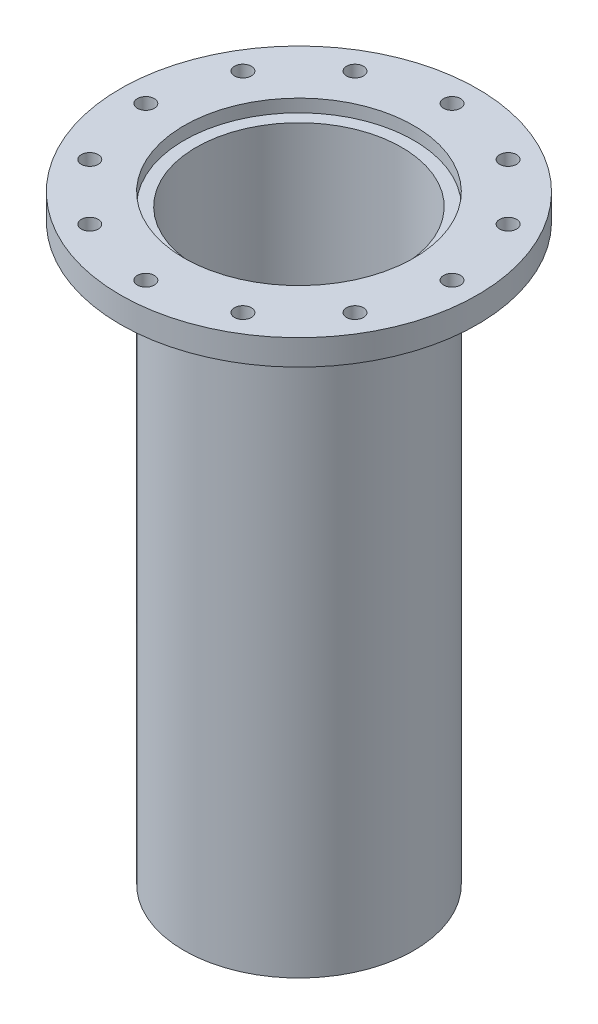
ISO-10303-21;
HEADER;
FILE_DESCRIPTION(('STEP AP214'),'2;1');
FILE_NAME('part.step','',(''),(''),'','','');
FILE_SCHEMA(('AUTOMOTIVE_DESIGN { 1 0 10303 214 1 1 1 1 }'));
ENDSEC;
DATA;
#1=APPLICATION_CONTEXT('core data for automotive mechanical design processes');
#2=APPLICATION_PROTOCOL_DEFINITION('international standard','automotive_design',2000,#1);
#3=PRODUCT_CONTEXT('',#1,'mechanical');
#4=PRODUCT('Part','Part','',(#3));
#5=PRODUCT_RELATED_PRODUCT_CATEGORY('part','',(#4));
#6=PRODUCT_DEFINITION_FORMATION('','',#4);
#7=PRODUCT_DEFINITION_CONTEXT('part definition',#1,'design');
#8=PRODUCT_DEFINITION('design','',#6,#7);
#9=PRODUCT_DEFINITION_SHAPE('','',#8);
#10=(LENGTH_UNIT() NAMED_UNIT(*) SI_UNIT(.MILLI.,.METRE.));
#11=(NAMED_UNIT(*) PLANE_ANGLE_UNIT() SI_UNIT($,.RADIAN.));
#12=(NAMED_UNIT(*) SI_UNIT($,.STERADIAN.) SOLID_ANGLE_UNIT());
#13=UNCERTAINTY_MEASURE_WITH_UNIT(LENGTH_MEASURE(1.E-05),#10,'distance_accuracy_value','');
#14=(GEOMETRIC_REPRESENTATION_CONTEXT(3) GLOBAL_UNCERTAINTY_ASSIGNED_CONTEXT((#13)) GLOBAL_UNIT_ASSIGNED_CONTEXT((#10,
#11,#12)) REPRESENTATION_CONTEXT('',''));
#15=CARTESIAN_POINT('',(0.,0.,0.));
#16=DIRECTION('',(0.,0.,1.));
#17=DIRECTION('',(1.,0.,0.));
#18=AXIS2_PLACEMENT_3D('',#15,#16,#17);
#19=CARTESIAN_POINT('',(0.,0.,0.));
#20=DIRECTION('',(0.,1.,0.));
#21=DIRECTION('',(0.,0.,1.));
#22=AXIS2_PLACEMENT_3D('',#19,#20,#21);
#23=CYLINDRICAL_SURFACE('',#22,57.15);
#24=CARTESIAN_POINT('',(0.,0.,0.));
#25=DIRECTION('',(0.,1.,0.));
#26=DIRECTION('',(0.,0.,1.));
#27=AXIS2_PLACEMENT_3D('',#24,#25,#26);
#28=CIRCLE('',#27,57.15);
#29=CARTESIAN_POINT('',(0.,0.,57.15));
#30=VERTEX_POINT('',#29);
#31=EDGE_CURVE('E10',#30,#30,#28,.T.);
#32=ORIENTED_EDGE('',*,*,#31,.T.);
#33=EDGE_LOOP('',(#32));
#34=FACE_BOUND('',#33,.T.);
#35=CARTESIAN_POINT('',(0.,-6.35,0.));
#36=DIRECTION('',(0.,1.,0.));
#37=DIRECTION('',(0.,0.,1.));
#38=AXIS2_PLACEMENT_3D('',#35,#36,#37);
#39=CIRCLE('',#38,57.15);
#40=CARTESIAN_POINT('',(0.,-6.35,57.15));
#41=VERTEX_POINT('',#40);
#42=EDGE_CURVE('E72',#41,#41,#39,.T.);
#43=ORIENTED_EDGE('',*,*,#42,.F.);
#44=EDGE_LOOP('',(#43));
#45=FACE_BOUND('',#44,.T.);
#46=ADVANCED_FACE('F37',(#34,#45),#23,.F.);
#47=CARTESIAN_POINT('',(-57.15,0.,0.));
#48=DIRECTION('',(0.,1.,0.));
#49=DIRECTION('',(0.,0.,1.));
#50=AXIS2_PLACEMENT_3D('',#47,#48,#49);
#51=PLANE('',#50);
#52=CARTESIAN_POINT('',(-38.0999999999999,0.,-65.9911357683743));
#53=DIRECTION('',(0.,1.,0.));
#54=DIRECTION('',(-0.86602540378444,0.,0.499999999999998));
#55=AXIS2_PLACEMENT_3D('',#52,#53,#54);
#56=CIRCLE('',#55,4.21639999999999);
#57=CARTESIAN_POINT('',(-41.7515095125166,0.,-63.8829357683743));
#58=VERTEX_POINT('',#57);
#59=EDGE_CURVE('E92',#58,#58,#56,.T.);
#60=ORIENTED_EDGE('',*,*,#59,.F.);
#61=EDGE_LOOP('',(#60));
#62=FACE_BOUND('',#61,.T.);
#63=CARTESIAN_POINT('',(2.66050878019847E-13,0.,-76.2));
#64=DIRECTION('',(0.,1.,0.));
#65=DIRECTION('',(-1.,0.,0.));
#66=AXIS2_PLACEMENT_3D('',#63,#64,#65);
#67=CIRCLE('',#66,4.21639999999999);
#68=CARTESIAN_POINT('',(-4.21639999999973,0.,-76.2));
#69=VERTEX_POINT('',#68);
#70=EDGE_CURVE('E143',#69,#69,#67,.T.);
#71=ORIENTED_EDGE('',*,*,#70,.F.);
#72=EDGE_LOOP('',(#71));
#73=FACE_BOUND('',#72,.T.);
#74=CARTESIAN_POINT('',(38.1000000000003,0.,-65.9911357683741));
#75=DIRECTION('',(0.,1.,0.));
#76=DIRECTION('',(-0.866025403784436,0.,-0.500000000000004));
#77=AXIS2_PLACEMENT_3D('',#74,#75,#76);
#78=CIRCLE('',#77,4.21639999999999);
#79=CARTESIAN_POINT('',(34.4484904874836,0.,-68.0993357683741));
#80=VERTEX_POINT('',#79);
#81=EDGE_CURVE('E135',#80,#80,#78,.T.);
#82=ORIENTED_EDGE('',*,*,#81,.F.);
#83=EDGE_LOOP('',(#82));
#84=FACE_BOUND('',#83,.T.);
#85=CARTESIAN_POINT('',(65.9911357683744,0.,-38.0999999999996));
#86=DIRECTION('',(0.,1.,0.));
#87=DIRECTION('',(-0.499999999999995,0.,-0.866025403784442));
#88=AXIS2_PLACEMENT_3D('',#85,#86,#87);
#89=CIRCLE('',#88,4.21639999999999);
#90=CARTESIAN_POINT('',(63.8829357683745,0.,-41.7515095125163));
#91=VERTEX_POINT('',#90);
#92=EDGE_CURVE('E127',#91,#91,#89,.T.);
#93=ORIENTED_EDGE('',*,*,#92,.F.);
#94=EDGE_LOOP('',(#93));
#95=FACE_BOUND('',#94,.T.);
#96=CARTESIAN_POINT('',(76.2,0.,0.));
#97=DIRECTION('',(0.,1.,0.));
#98=DIRECTION('',(0.,0.,-1.));
#99=AXIS2_PLACEMENT_3D('',#96,#97,#98);
#100=CIRCLE('',#99,4.21639999999999);
#101=CARTESIAN_POINT('',(76.2,0.,-4.21639999999999));
#102=VERTEX_POINT('',#101);
#103=EDGE_CURVE('E119',#102,#102,#100,.T.);
#104=ORIENTED_EDGE('',*,*,#103,.F.);
#105=EDGE_LOOP('',(#104));
#106=FACE_BOUND('',#105,.T.);
#107=CARTESIAN_POINT('',(65.9911357683739,0.,38.1000000000005));
#108=DIRECTION('',(0.,1.,0.));
#109=DIRECTION('',(0.500000000000007,0.,-0.866025403784435));
#110=AXIS2_PLACEMENT_3D('',#107,#108,#109);
#111=CIRCLE('',#110,4.21639999999999);
#112=CARTESIAN_POINT('',(68.099335768374,0.,34.4484904874839));
#113=VERTEX_POINT('',#112);
#114=EDGE_CURVE('E111',#113,#113,#111,.T.);
#115=ORIENTED_EDGE('',*,*,#114,.F.);
#116=EDGE_LOOP('',(#115));
#117=FACE_BOUND('',#116,.T.);
#118=CARTESIAN_POINT('',(38.0999999999994,0.,65.9911357683746));
#119=DIRECTION('',(0.,1.,0.));
#120=DIRECTION('',(0.866025403784443,0.,-0.499999999999992));
#121=AXIS2_PLACEMENT_3D('',#118,#119,#120);
#122=CIRCLE('',#121,4.21639999999999);
#123=CARTESIAN_POINT('',(41.7515095125161,0.,63.8829357683746));
#124=VERTEX_POINT('',#123);
#125=EDGE_CURVE('E103',#124,#124,#122,.T.);
#126=ORIENTED_EDGE('',*,*,#125,.F.);
#127=EDGE_LOOP('',(#126));
#128=FACE_BOUND('',#127,.T.);
#129=CARTESIAN_POINT('',(-7.9815263405954E-13,0.,76.2));
#130=DIRECTION('',(0.,1.,0.));
#131=DIRECTION('',(1.,0.,0.));
#132=AXIS2_PLACEMENT_3D('',#129,#130,#131);
#133=CIRCLE('',#132,4.21639999999999);
#134=CARTESIAN_POINT('',(4.2163999999992,0.,76.2));
#135=VERTEX_POINT('',#134);
#136=EDGE_CURVE('E93',#135,#135,#133,.T.);
#137=ORIENTED_EDGE('',*,*,#136,.F.);
#138=EDGE_LOOP('',(#137));
#139=FACE_BOUND('',#138,.T.);
#140=CARTESIAN_POINT('',(-38.1000000000008,0.,65.9911357683738));
#141=DIRECTION('',(0.,1.,0.));
#142=DIRECTION('',(0.866025403784433,0.,0.50000000000001));
#143=AXIS2_PLACEMENT_3D('',#140,#141,#142);
#144=CIRCLE('',#143,4.21639999999999);
#145=CARTESIAN_POINT('',(-34.4484904874841,0.,68.0993357683738));
#146=VERTEX_POINT('',#145);
#147=EDGE_CURVE('E102',#146,#146,#144,.T.);
#148=ORIENTED_EDGE('',*,*,#147,.F.);
#149=EDGE_LOOP('',(#148));
#150=FACE_BOUND('',#149,.T.);
#151=CARTESIAN_POINT('',(-65.9911357683747,0.,38.0999999999992));
#152=DIRECTION('',(0.,1.,0.));
#153=DIRECTION('',(0.499999999999989,0.,0.866025403784445));
#154=AXIS2_PLACEMENT_3D('',#151,#152,#153);
#155=CIRCLE('',#154,4.21639999999999);
#156=CARTESIAN_POINT('',(-63.8829357683748,0.,41.7515095125159));
#157=VERTEX_POINT('',#156);
#158=EDGE_CURVE('E157',#157,#157,#155,.T.);
#159=ORIENTED_EDGE('',*,*,#158,.F.);
#160=EDGE_LOOP('',(#159));
#161=FACE_BOUND('',#160,.T.);
#162=CARTESIAN_POINT('',(-65.9911357683742,0.,-38.1000000000001));
#163=DIRECTION('',(0.,1.,0.));
#164=DIRECTION('',(-0.500000000000001,0.,0.866025403784438));
#165=AXIS2_PLACEMENT_3D('',#162,#163,#164);
#166=CIRCLE('',#165,4.21639999999999);
#167=CARTESIAN_POINT('',(-68.0993357683742,0.,-34.4484904874834));
#168=VERTEX_POINT('',#167);
#169=EDGE_CURVE('E84',#168,#168,#166,.T.);
#170=ORIENTED_EDGE('',*,*,#169,.F.);
#171=EDGE_LOOP('',(#170));
#172=FACE_BOUND('',#171,.T.);
#173=CARTESIAN_POINT('',(-76.2,0.,0.));
#174=DIRECTION('',(0.,1.,0.));
#175=DIRECTION('',(0.,0.,1.));
#176=AXIS2_PLACEMENT_3D('',#173,#174,#175);
#177=CIRCLE('',#176,4.21639999999999);
#178=CARTESIAN_POINT('',(-76.2,0.,4.21639999999999));
#179=VERTEX_POINT('',#178);
#180=EDGE_CURVE('E80',#179,#179,#177,.T.);
#181=ORIENTED_EDGE('',*,*,#180,.F.);
#182=EDGE_LOOP('',(#181));
#183=FACE_BOUND('',#182,.T.);
#184=CARTESIAN_POINT('',(0.,0.,0.));
#185=DIRECTION('',(0.,1.,0.));
#186=DIRECTION('',(0.,0.,1.));
#187=AXIS2_PLACEMENT_3D('',#184,#185,#186);
#188=CIRCLE('',#187,88.9);
#189=CARTESIAN_POINT('',(0.,0.,88.9));
#190=VERTEX_POINT('',#189);
#191=EDGE_CURVE('E44',#190,#190,#188,.T.);
#192=ORIENTED_EDGE('',*,*,#191,.T.);
#193=EDGE_LOOP('',(#192));
#194=FACE_BOUND('',#193,.T.);
#195=ORIENTED_EDGE('',*,*,#31,.F.);
#196=EDGE_LOOP('',(#195));
#197=FACE_BOUND('',#196,.T.);
#198=ADVANCED_FACE('F195',(#62,#73,#84,#95,#106,#117,#128,#139,#150,#161,#172,#183,#194,#197),
#51,.T.);
#199=CARTESIAN_POINT('',(0.,0.,0.));
#200=DIRECTION('',(0.,1.,0.));
#201=DIRECTION('',(0.,0.,1.));
#202=AXIS2_PLACEMENT_3D('',#199,#200,#201);
#203=CYLINDRICAL_SURFACE('',#202,88.9);
#204=CARTESIAN_POINT('',(0.,-12.7,0.));
#205=DIRECTION('',(0.,1.,0.));
#206=DIRECTION('',(0.,0.,1.));
#207=AXIS2_PLACEMENT_3D('',#204,#205,#206);
#208=CIRCLE('',#207,88.9);
#209=CARTESIAN_POINT('',(0.,-12.7,88.9));
#210=VERTEX_POINT('',#209);
#211=EDGE_CURVE('E49',#210,#210,#208,.T.);
#212=ORIENTED_EDGE('',*,*,#211,.T.);
#213=EDGE_LOOP('',(#212));
#214=FACE_BOUND('',#213,.T.);
#215=ORIENTED_EDGE('',*,*,#191,.F.);
#216=EDGE_LOOP('',(#215));
#217=FACE_BOUND('',#216,.T.);
#218=ADVANCED_FACE('F180',(#214,#217),#203,.T.);
#219=CARTESIAN_POINT('',(-88.9,-12.7,0.));
#220=DIRECTION('',(0.,-1.,0.));
#221=DIRECTION('',(0.,0.,-1.));
#222=AXIS2_PLACEMENT_3D('',#219,#220,#221);
#223=PLANE('',#222);
#224=CARTESIAN_POINT('',(-38.0999999999999,-12.7,-65.9911357683743));
#225=DIRECTION('',(0.,-1.,0.));
#226=DIRECTION('',(0.86602540378444,0.,-0.499999999999998));
#227=AXIS2_PLACEMENT_3D('',#224,#225,#226);
#228=CIRCLE('',#227,4.21639999999996);
#229=CARTESIAN_POINT('',(-34.4484904874832,-12.7,-68.0993357683743));
#230=VERTEX_POINT('',#229);
#231=EDGE_CURVE('E147',#230,#230,#228,.T.);
#232=ORIENTED_EDGE('',*,*,#231,.F.);
#233=EDGE_LOOP('',(#232));
#234=FACE_BOUND('',#233,.T.);
#235=CARTESIAN_POINT('',(2.66050878019847E-13,-12.7,-76.2));
#236=DIRECTION('',(0.,-1.,0.));
#237=DIRECTION('',(1.,0.,0.));
#238=AXIS2_PLACEMENT_3D('',#235,#236,#237);
#239=CIRCLE('',#238,4.21639999999996);
#240=CARTESIAN_POINT('',(4.21640000000023,-12.7,-76.2));
#241=VERTEX_POINT('',#240);
#242=EDGE_CURVE('E139',#241,#241,#239,.T.);
#243=ORIENTED_EDGE('',*,*,#242,.F.);
#244=EDGE_LOOP('',(#243));
#245=FACE_BOUND('',#244,.T.);
#246=CARTESIAN_POINT('',(38.1000000000003,-12.7,-65.9911357683741));
#247=DIRECTION('',(0.,-1.,0.));
#248=DIRECTION('',(0.866025403784436,0.,0.500000000000004));
#249=AXIS2_PLACEMENT_3D('',#246,#247,#248);
#250=CIRCLE('',#249,4.21639999999996);
#251=CARTESIAN_POINT('',(41.751509512517,-12.7,-63.8829357683741));
#252=VERTEX_POINT('',#251);
#253=EDGE_CURVE('E131',#252,#252,#250,.T.);
#254=ORIENTED_EDGE('',*,*,#253,.F.);
#255=EDGE_LOOP('',(#254));
#256=FACE_BOUND('',#255,.T.);
#257=CARTESIAN_POINT('',(65.9911357683744,-12.7,-38.0999999999996));
#258=DIRECTION('',(0.,-1.,0.));
#259=DIRECTION('',(0.499999999999995,0.,0.866025403784442));
#260=AXIS2_PLACEMENT_3D('',#257,#258,#259);
#261=CIRCLE('',#260,4.21639999999996);
#262=CARTESIAN_POINT('',(68.0993357683744,-12.7,-34.4484904874829));
#263=VERTEX_POINT('',#262);
#264=EDGE_CURVE('E123',#263,#263,#261,.T.);
#265=ORIENTED_EDGE('',*,*,#264,.F.);
#266=EDGE_LOOP('',(#265));
#267=FACE_BOUND('',#266,.T.);
#268=CARTESIAN_POINT('',(76.2,-12.7,0.));
#269=DIRECTION('',(0.,-1.,0.));
#270=DIRECTION('',(0.,0.,1.));
#271=AXIS2_PLACEMENT_3D('',#268,#269,#270);
#272=CIRCLE('',#271,4.21639999999996);
#273=CARTESIAN_POINT('',(76.2,-12.7,4.21639999999996));
#274=VERTEX_POINT('',#273);
#275=EDGE_CURVE('E115',#274,#274,#272,.T.);
#276=ORIENTED_EDGE('',*,*,#275,.F.);
#277=EDGE_LOOP('',(#276));
#278=FACE_BOUND('',#277,.T.);
#279=CARTESIAN_POINT('',(65.9911357683739,-12.7,38.1000000000005));
#280=DIRECTION('',(0.,-1.,0.));
#281=DIRECTION('',(-0.500000000000007,0.,0.866025403784435));
#282=AXIS2_PLACEMENT_3D('',#279,#280,#281);
#283=CIRCLE('',#282,4.21639999999996);
#284=CARTESIAN_POINT('',(63.8829357683739,-12.7,41.7515095125172));
#285=VERTEX_POINT('',#284);
#286=EDGE_CURVE('E107',#285,#285,#283,.T.);
#287=ORIENTED_EDGE('',*,*,#286,.F.);
#288=EDGE_LOOP('',(#287));
#289=FACE_BOUND('',#288,.T.);
#290=CARTESIAN_POINT('',(38.0999999999994,-12.7,65.9911357683746));
#291=DIRECTION('',(0.,-1.,0.));
#292=DIRECTION('',(-0.866025403784443,0.,0.499999999999992));
#293=AXIS2_PLACEMENT_3D('',#290,#291,#292);
#294=CIRCLE('',#293,4.21639999999996);
#295=CARTESIAN_POINT('',(34.4484904874827,-12.7,68.0993357683745));
#296=VERTEX_POINT('',#295);
#297=EDGE_CURVE('E97',#296,#296,#294,.T.);
#298=ORIENTED_EDGE('',*,*,#297,.F.);
#299=EDGE_LOOP('',(#298));
#300=FACE_BOUND('',#299,.T.);
#301=CARTESIAN_POINT('',(-7.9815263405954E-13,-12.7,76.2));
#302=DIRECTION('',(0.,-1.,0.));
#303=DIRECTION('',(-1.,0.,0.));
#304=AXIS2_PLACEMENT_3D('',#301,#302,#303);
#305=CIRCLE('',#304,4.21639999999996);
#306=CARTESIAN_POINT('',(-4.21640000000076,-12.7,76.2));
#307=VERTEX_POINT('',#306);
#308=EDGE_CURVE('E98',#307,#307,#305,.T.);
#309=ORIENTED_EDGE('',*,*,#308,.F.);
#310=EDGE_LOOP('',(#309));
#311=FACE_BOUND('',#310,.T.);
#312=CARTESIAN_POINT('',(-38.1000000000008,-12.7,65.9911357683738));
#313=DIRECTION('',(0.,-1.,0.));
#314=DIRECTION('',(-0.866025403784433,0.,-0.50000000000001));
#315=AXIS2_PLACEMENT_3D('',#312,#313,#314);
#316=CIRCLE('',#315,4.21639999999996);
#317=CARTESIAN_POINT('',(-41.7515095125174,-12.7,63.8829357683738));
#318=VERTEX_POINT('',#317);
#319=EDGE_CURVE('E161',#318,#318,#316,.T.);
#320=ORIENTED_EDGE('',*,*,#319,.F.);
#321=EDGE_LOOP('',(#320));
#322=FACE_BOUND('',#321,.T.);
#323=CARTESIAN_POINT('',(-65.9911357683747,-12.7,38.0999999999992));
#324=DIRECTION('',(0.,-1.,0.));
#325=DIRECTION('',(-0.499999999999989,0.,-0.866025403784445));
#326=AXIS2_PLACEMENT_3D('',#323,#324,#325);
#327=CIRCLE('',#326,4.21639999999996);
#328=CARTESIAN_POINT('',(-68.0993357683747,-12.7,34.4484904874825));
#329=VERTEX_POINT('',#328);
#330=EDGE_CURVE('E162',#329,#329,#327,.T.);
#331=ORIENTED_EDGE('',*,*,#330,.F.);
#332=EDGE_LOOP('',(#331));
#333=FACE_BOUND('',#332,.T.);
#334=CARTESIAN_POINT('',(-65.9911357683742,-12.7,-38.1000000000001));
#335=DIRECTION('',(0.,-1.,0.));
#336=DIRECTION('',(0.500000000000001,0.,-0.866025403784438));
#337=AXIS2_PLACEMENT_3D('',#334,#335,#336);
#338=CIRCLE('',#337,4.21639999999996);
#339=CARTESIAN_POINT('',(-63.8829357683742,-12.7,-41.7515095125167));
#340=VERTEX_POINT('',#339);
#341=EDGE_CURVE('E88',#340,#340,#338,.T.);
#342=ORIENTED_EDGE('',*,*,#341,.F.);
#343=EDGE_LOOP('',(#342));
#344=FACE_BOUND('',#343,.T.);
#345=CARTESIAN_POINT('',(-76.2,-12.7,0.));
#346=DIRECTION('',(0.,-1.,0.));
#347=DIRECTION('',(0.,0.,-1.));
#348=AXIS2_PLACEMENT_3D('',#345,#346,#347);
#349=CIRCLE('',#348,4.21639999999996);
#350=CARTESIAN_POINT('',(-76.2,-12.7,-4.21639999999996));
#351=VERTEX_POINT('',#350);
#352=EDGE_CURVE('E76',#351,#351,#349,.T.);
#353=ORIENTED_EDGE('',*,*,#352,.F.);
#354=EDGE_LOOP('',(#353));
#355=FACE_BOUND('',#354,.T.);
#356=CARTESIAN_POINT('',(0.,-12.7,0.));
#357=DIRECTION('',(0.,1.,0.));
#358=DIRECTION('',(0.,0.,1.));
#359=AXIS2_PLACEMENT_3D('',#356,#357,#358);
#360=CIRCLE('',#359,57.15);
#361=CARTESIAN_POINT('',(0.,-12.7,57.15));
#362=VERTEX_POINT('',#361);
#363=EDGE_CURVE('E54',#362,#362,#360,.T.);
#364=ORIENTED_EDGE('',*,*,#363,.T.);
#365=EDGE_LOOP('',(#364));
#366=FACE_BOUND('',#365,.T.);
#367=ORIENTED_EDGE('',*,*,#211,.F.);
#368=EDGE_LOOP('',(#367));
#369=FACE_BOUND('',#368,.T.);
#370=ADVANCED_FACE('F176',(#234,#245,#256,#267,#278,#289,#300,#311,#322,#333,#344,#355,#366,
#369),#223,.T.);
#371=CARTESIAN_POINT('',(0.,0.,0.));
#372=DIRECTION('',(0.,1.,0.));
#373=DIRECTION('',(0.,0.,1.));
#374=AXIS2_PLACEMENT_3D('',#371,#372,#373);
#375=CYLINDRICAL_SURFACE('',#374,57.15);
#376=CARTESIAN_POINT('',(0.,-298.45,0.));
#377=DIRECTION('',(0.,1.,0.));
#378=DIRECTION('',(0.,0.,1.));
#379=AXIS2_PLACEMENT_3D('',#376,#377,#378);
#380=CIRCLE('',#379,57.15);
#381=CARTESIAN_POINT('',(0.,-298.45,57.15));
#382=VERTEX_POINT('',#381);
#383=EDGE_CURVE('E60',#382,#382,#380,.T.);
#384=ORIENTED_EDGE('',*,*,#383,.T.);
#385=EDGE_LOOP('',(#384));
#386=FACE_BOUND('',#385,.T.);
#387=ORIENTED_EDGE('',*,*,#363,.F.);
#388=EDGE_LOOP('',(#387));
#389=FACE_BOUND('',#388,.T.);
#390=ADVANCED_FACE('F179',(#386,#389),#375,.T.);
#391=CARTESIAN_POINT('',(-57.15,-298.45,0.));
#392=DIRECTION('',(0.,-1.,0.));
#393=DIRECTION('',(0.,0.,-1.));
#394=AXIS2_PLACEMENT_3D('',#391,#392,#393);
#395=PLANE('',#394);
#396=CARTESIAN_POINT('',(0.,-298.45,0.));
#397=DIRECTION('',(0.,1.,0.));
#398=DIRECTION('',(0.,0.,1.));
#399=AXIS2_PLACEMENT_3D('',#396,#397,#398);
#400=CIRCLE('',#399,51.1302);
#401=CARTESIAN_POINT('',(0.,-298.45,51.1302));
#402=VERTEX_POINT('',#401);
#403=EDGE_CURVE('E64',#402,#402,#400,.T.);
#404=ORIENTED_EDGE('',*,*,#403,.T.);
#405=EDGE_LOOP('',(#404));
#406=FACE_BOUND('',#405,.T.);
#407=ORIENTED_EDGE('',*,*,#383,.F.);
#408=EDGE_LOOP('',(#407));
#409=FACE_BOUND('',#408,.T.);
#410=ADVANCED_FACE('F217',(#406,#409),#395,.T.);
#411=CARTESIAN_POINT('',(0.,0.,0.));
#412=DIRECTION('',(0.,1.,0.));
#413=DIRECTION('',(0.,0.,1.));
#414=AXIS2_PLACEMENT_3D('',#411,#412,#413);
#415=CYLINDRICAL_SURFACE('',#414,51.1302);
#416=CARTESIAN_POINT('',(0.,-6.35,0.));
#417=DIRECTION('',(0.,1.,0.));
#418=DIRECTION('',(0.,0.,1.));
#419=AXIS2_PLACEMENT_3D('',#416,#417,#418);
#420=CIRCLE('',#419,51.1302);
#421=CARTESIAN_POINT('',(0.,-6.35,51.1302));
#422=VERTEX_POINT('',#421);
#423=EDGE_CURVE('E68',#422,#422,#420,.T.);
#424=ORIENTED_EDGE('',*,*,#423,.T.);
#425=EDGE_LOOP('',(#424));
#426=FACE_BOUND('',#425,.T.);
#427=ORIENTED_EDGE('',*,*,#403,.F.);
#428=EDGE_LOOP('',(#427));
#429=FACE_BOUND('',#428,.T.);
#430=ADVANCED_FACE('F211',(#426,#429),#415,.F.);
#431=CARTESIAN_POINT('',(-51.1302,-6.35,0.));
#432=DIRECTION('',(0.,1.,0.));
#433=DIRECTION('',(0.,0.,1.));
#434=AXIS2_PLACEMENT_3D('',#431,#432,#433);
#435=PLANE('',#434);
#436=ORIENTED_EDGE('',*,*,#42,.T.);
#437=EDGE_LOOP('',(#436));
#438=FACE_BOUND('',#437,.T.);
#439=ORIENTED_EDGE('',*,*,#423,.F.);
#440=EDGE_LOOP('',(#439));
#441=FACE_BOUND('',#440,.T.);
#442=ADVANCED_FACE('F207',(#438,#441),#435,.T.);
#443=CARTESIAN_POINT('',(-76.2,0.,0.));
#444=DIRECTION('',(0.,1.,0.));
#445=DIRECTION('',(0.,0.,1.));
#446=AXIS2_PLACEMENT_3D('',#443,#444,#445);
#447=CYLINDRICAL_SURFACE('',#446,4.21639999999996);
#448=ORIENTED_EDGE('',*,*,#352,.T.);
#449=EDGE_LOOP('',(#448));
#450=FACE_BOUND('',#449,.T.);
#451=ORIENTED_EDGE('',*,*,#180,.T.);
#452=EDGE_LOOP('',(#451));
#453=FACE_BOUND('',#452,.T.);
#454=ADVANCED_FACE('F210',(#450,#453),#447,.F.);
#455=CARTESIAN_POINT('',(-65.9911357683742,0.,-38.1000000000001));
#456=DIRECTION('',(0.,1.,0.));
#457=DIRECTION('',(-0.500000000000001,0.,0.866025403784438));
#458=AXIS2_PLACEMENT_3D('',#455,#456,#457);
#459=CYLINDRICAL_SURFACE('',#458,4.21639999999996);
#460=ORIENTED_EDGE('',*,*,#341,.T.);
#461=EDGE_LOOP('',(#460));
#462=FACE_BOUND('',#461,.T.);
#463=ORIENTED_EDGE('',*,*,#169,.T.);
#464=EDGE_LOOP('',(#463));
#465=FACE_BOUND('',#464,.T.);
#466=ADVANCED_FACE('F234',(#462,#465),#459,.F.);
#467=CARTESIAN_POINT('',(-65.9911357683747,0.,38.0999999999992));
#468=DIRECTION('',(0.,1.,0.));
#469=DIRECTION('',(0.499999999999989,0.,0.866025403784445));
#470=AXIS2_PLACEMENT_3D('',#467,#468,#469);
#471=CYLINDRICAL_SURFACE('',#470,4.21639999999996);
#472=ORIENTED_EDGE('',*,*,#330,.T.);
#473=EDGE_LOOP('',(#472));
#474=FACE_BOUND('',#473,.T.);
#475=ORIENTED_EDGE('',*,*,#158,.T.);
#476=EDGE_LOOP('',(#475));
#477=FACE_BOUND('',#476,.T.);
#478=ADVANCED_FACE('F238',(#474,#477),#471,.F.);
#479=CARTESIAN_POINT('',(-38.1000000000008,0.,65.9911357683738));
#480=DIRECTION('',(0.,1.,0.));
#481=DIRECTION('',(0.866025403784433,0.,0.50000000000001));
#482=AXIS2_PLACEMENT_3D('',#479,#480,#481);
#483=CYLINDRICAL_SURFACE('',#482,4.21639999999996);
#484=ORIENTED_EDGE('',*,*,#319,.T.);
#485=EDGE_LOOP('',(#484));
#486=FACE_BOUND('',#485,.T.);
#487=ORIENTED_EDGE('',*,*,#147,.T.);
#488=EDGE_LOOP('',(#487));
#489=FACE_BOUND('',#488,.T.);
#490=ADVANCED_FACE('F173',(#486,#489),#483,.F.);
#491=CARTESIAN_POINT('',(-7.9815263405954E-13,0.,76.2));
#492=DIRECTION('',(0.,1.,0.));
#493=DIRECTION('',(1.,0.,0.));
#494=AXIS2_PLACEMENT_3D('',#491,#492,#493);
#495=CYLINDRICAL_SURFACE('',#494,4.21639999999996);
#496=ORIENTED_EDGE('',*,*,#308,.T.);
#497=EDGE_LOOP('',(#496));
#498=FACE_BOUND('',#497,.T.);
#499=ORIENTED_EDGE('',*,*,#136,.T.);
#500=EDGE_LOOP('',(#499));
#501=FACE_BOUND('',#500,.T.);
#502=ADVANCED_FACE('F240',(#498,#501),#495,.F.);
#503=CARTESIAN_POINT('',(38.0999999999994,0.,65.9911357683746));
#504=DIRECTION('',(0.,1.,0.));
#505=DIRECTION('',(0.866025403784443,0.,-0.499999999999992));
#506=AXIS2_PLACEMENT_3D('',#503,#504,#505);
#507=CYLINDRICAL_SURFACE('',#506,4.21639999999996);
#508=ORIENTED_EDGE('',*,*,#297,.T.);
#509=EDGE_LOOP('',(#508));
#510=FACE_BOUND('',#509,.T.);
#511=ORIENTED_EDGE('',*,*,#125,.T.);
#512=EDGE_LOOP('',(#511));
#513=FACE_BOUND('',#512,.T.);
#514=ADVANCED_FACE('F243',(#510,#513),#507,.F.);
#515=CARTESIAN_POINT('',(65.9911357683739,0.,38.1000000000005));
#516=DIRECTION('',(0.,1.,0.));
#517=DIRECTION('',(0.500000000000007,0.,-0.866025403784435));
#518=AXIS2_PLACEMENT_3D('',#515,#516,#517);
#519=CYLINDRICAL_SURFACE('',#518,4.21639999999996);
#520=ORIENTED_EDGE('',*,*,#286,.T.);
#521=EDGE_LOOP('',(#520));
#522=FACE_BOUND('',#521,.T.);
#523=ORIENTED_EDGE('',*,*,#114,.T.);
#524=EDGE_LOOP('',(#523));
#525=FACE_BOUND('',#524,.T.);
#526=ADVANCED_FACE('F247',(#522,#525),#519,.F.);
#527=CARTESIAN_POINT('',(76.2,0.,0.));
#528=DIRECTION('',(0.,1.,0.));
#529=DIRECTION('',(0.,0.,-1.));
#530=AXIS2_PLACEMENT_3D('',#527,#528,#529);
#531=CYLINDRICAL_SURFACE('',#530,4.21639999999996);
#532=ORIENTED_EDGE('',*,*,#275,.T.);
#533=EDGE_LOOP('',(#532));
#534=FACE_BOUND('',#533,.T.);
#535=ORIENTED_EDGE('',*,*,#103,.T.);
#536=EDGE_LOOP('',(#535));
#537=FACE_BOUND('',#536,.T.);
#538=ADVANCED_FACE('F251',(#534,#537),#531,.F.);
#539=CARTESIAN_POINT('',(65.9911357683744,0.,-38.0999999999996));
#540=DIRECTION('',(0.,1.,0.));
#541=DIRECTION('',(-0.499999999999995,0.,-0.866025403784442));
#542=AXIS2_PLACEMENT_3D('',#539,#540,#541);
#543=CYLINDRICAL_SURFACE('',#542,4.21639999999996);
#544=ORIENTED_EDGE('',*,*,#264,.T.);
#545=EDGE_LOOP('',(#544));
#546=FACE_BOUND('',#545,.T.);
#547=ORIENTED_EDGE('',*,*,#92,.T.);
#548=EDGE_LOOP('',(#547));
#549=FACE_BOUND('',#548,.T.);
#550=ADVANCED_FACE('F255',(#546,#549),#543,.F.);
#551=CARTESIAN_POINT('',(38.1000000000003,0.,-65.9911357683741));
#552=DIRECTION('',(0.,1.,0.));
#553=DIRECTION('',(-0.866025403784436,0.,-0.500000000000004));
#554=AXIS2_PLACEMENT_3D('',#551,#552,#553);
#555=CYLINDRICAL_SURFACE('',#554,4.21639999999996);
#556=ORIENTED_EDGE('',*,*,#253,.T.);
#557=EDGE_LOOP('',(#556));
#558=FACE_BOUND('',#557,.T.);
#559=ORIENTED_EDGE('',*,*,#81,.T.);
#560=EDGE_LOOP('',(#559));
#561=FACE_BOUND('',#560,.T.);
#562=ADVANCED_FACE('F259',(#558,#561),#555,.F.);
#563=CARTESIAN_POINT('',(2.66050878019847E-13,0.,-76.2));
#564=DIRECTION('',(0.,1.,0.));
#565=DIRECTION('',(-1.,0.,0.));
#566=AXIS2_PLACEMENT_3D('',#563,#564,#565);
#567=CYLINDRICAL_SURFACE('',#566,4.21639999999996);
#568=ORIENTED_EDGE('',*,*,#242,.T.);
#569=EDGE_LOOP('',(#568));
#570=FACE_BOUND('',#569,.T.);
#571=ORIENTED_EDGE('',*,*,#70,.T.);
#572=EDGE_LOOP('',(#571));
#573=FACE_BOUND('',#572,.T.);
#574=ADVANCED_FACE('F263',(#570,#573),#567,.F.);
#575=CARTESIAN_POINT('',(-38.0999999999999,0.,-65.9911357683743));
#576=DIRECTION('',(0.,1.,0.));
#577=DIRECTION('',(-0.86602540378444,0.,0.499999999999998));
#578=AXIS2_PLACEMENT_3D('',#575,#576,#577);
#579=CYLINDRICAL_SURFACE('',#578,4.21639999999996);
#580=ORIENTED_EDGE('',*,*,#231,.T.);
#581=EDGE_LOOP('',(#580));
#582=FACE_BOUND('',#581,.T.);
#583=ORIENTED_EDGE('',*,*,#59,.T.);
#584=EDGE_LOOP('',(#583));
#585=FACE_BOUND('',#584,.T.);
#586=ADVANCED_FACE('F267',(#582,#585),#579,.F.);
#587=CLOSED_SHELL('',(#46,#198,#218,#370,#390,#410,#430,#442,#454,#466,#478,#490,#502,#514,#526,
#538,#550,#562,#574,#586));
#588=MANIFOLD_SOLID_BREP('B2',#587);
#589=ADVANCED_BREP_SHAPE_REPRESENTATION('',(#18,#588),#14);
#590=SHAPE_DEFINITION_REPRESENTATION(#9,#589);
ENDSEC;
END-ISO-10303-21;
